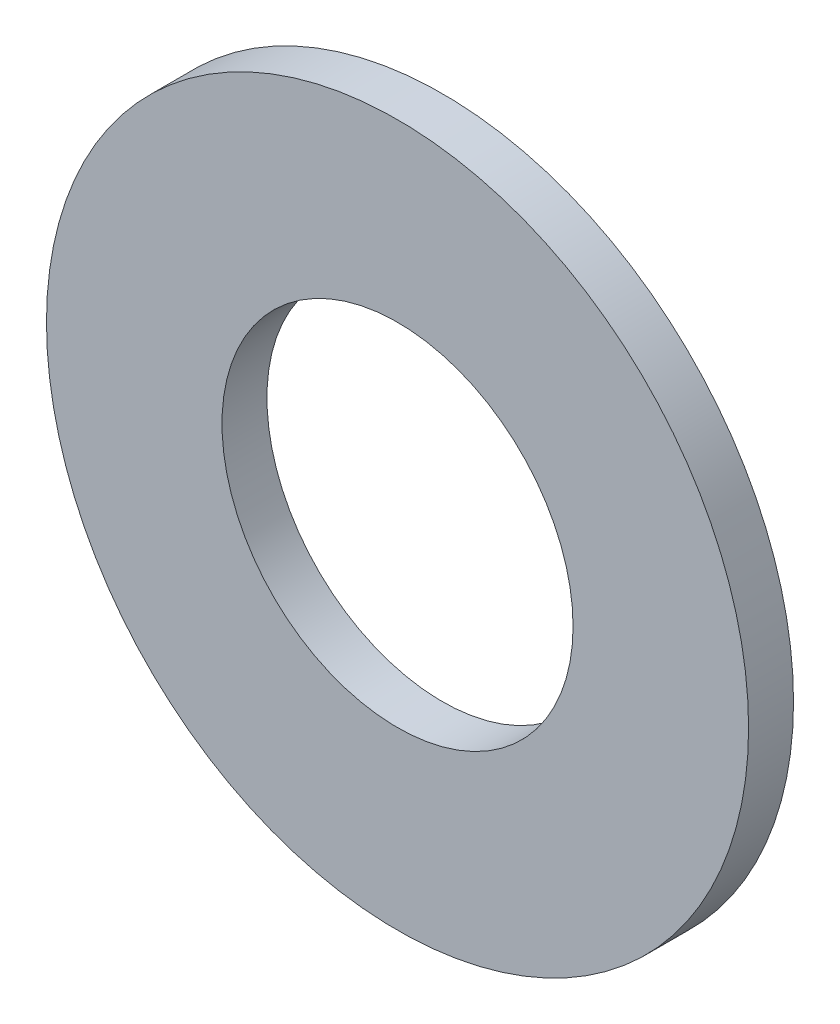
ISO-10303-21;
HEADER;
FILE_DESCRIPTION(('STEP AP214'),'2;1');
FILE_NAME('part.step','',(''),(''),'','','');
FILE_SCHEMA(('AUTOMOTIVE_DESIGN { 1 0 10303 214 1 1 1 1 }'));
ENDSEC;
DATA;
#1=APPLICATION_CONTEXT('core data for automotive mechanical design processes');
#2=APPLICATION_PROTOCOL_DEFINITION('international standard','automotive_design',2000,#1);
#3=PRODUCT_CONTEXT('',#1,'mechanical');
#4=PRODUCT('Part','Part','',(#3));
#5=PRODUCT_RELATED_PRODUCT_CATEGORY('part','',(#4));
#6=PRODUCT_DEFINITION_FORMATION('','',#4);
#7=PRODUCT_DEFINITION_CONTEXT('part definition',#1,'design');
#8=PRODUCT_DEFINITION('design','',#6,#7);
#9=PRODUCT_DEFINITION_SHAPE('','',#8);
#10=(LENGTH_UNIT() NAMED_UNIT(*) SI_UNIT(.MILLI.,.METRE.));
#11=(NAMED_UNIT(*) PLANE_ANGLE_UNIT() SI_UNIT($,.RADIAN.));
#12=(NAMED_UNIT(*) SI_UNIT($,.STERADIAN.) SOLID_ANGLE_UNIT());
#13=UNCERTAINTY_MEASURE_WITH_UNIT(LENGTH_MEASURE(1.E-05),#10,'distance_accuracy_value','');
#14=(GEOMETRIC_REPRESENTATION_CONTEXT(3) GLOBAL_UNCERTAINTY_ASSIGNED_CONTEXT((#13)) GLOBAL_UNIT_ASSIGNED_CONTEXT((#10,
#11,#12)) REPRESENTATION_CONTEXT('',''));
#15=CARTESIAN_POINT('',(0.,0.,0.));
#16=DIRECTION('',(0.,0.,1.));
#17=DIRECTION('',(1.,0.,0.));
#18=AXIS2_PLACEMENT_3D('',#15,#16,#17);
#19=CARTESIAN_POINT('',(0.,0.,-0.508));
#20=DIRECTION('',(0.,0.,1.));
#21=DIRECTION('',(1.,0.,0.));
#22=AXIS2_PLACEMENT_3D('',#19,#20,#21);
#23=CYLINDRICAL_SURFACE('',#22,3.96875);
#24=CARTESIAN_POINT('',(0.,0.,-0.508));
#25=DIRECTION('',(0.,0.,1.));
#26=DIRECTION('',(1.,0.,0.));
#27=AXIS2_PLACEMENT_3D('',#24,#25,#26);
#28=CIRCLE('',#27,3.96875);
#29=CARTESIAN_POINT('',(3.96875,0.,-0.508));
#30=VERTEX_POINT('',#29);
#31=EDGE_CURVE('E10',#30,#30,#28,.T.);
#32=ORIENTED_EDGE('',*,*,#31,.T.);
#33=EDGE_LOOP('',(#32));
#34=FACE_BOUND('',#33,.T.);
#35=CARTESIAN_POINT('',(0.,0.,0.));
#36=DIRECTION('',(0.,0.,1.));
#37=DIRECTION('',(1.,0.,0.));
#38=AXIS2_PLACEMENT_3D('',#35,#36,#37);
#39=CIRCLE('',#38,3.96875);
#40=CARTESIAN_POINT('',(3.96875,0.,0.));
#41=VERTEX_POINT('',#40);
#42=EDGE_CURVE('E40',#41,#41,#39,.T.);
#43=ORIENTED_EDGE('',*,*,#42,.F.);
#44=EDGE_LOOP('',(#43));
#45=FACE_BOUND('',#44,.T.);
#46=ADVANCED_FACE('F37',(#34,#45),#23,.T.);
#47=CARTESIAN_POINT('',(0.,0.,-0.508));
#48=DIRECTION('',(0.,0.,1.));
#49=DIRECTION('',(1.,0.,0.));
#50=AXIS2_PLACEMENT_3D('',#47,#48,#49);
#51=PLANE('',#50);
#52=CARTESIAN_POINT('',(0.,0.,-0.508));
#53=DIRECTION('',(0.,0.,1.));
#54=DIRECTION('',(1.,0.,0.));
#55=AXIS2_PLACEMENT_3D('',#52,#53,#54);
#56=CIRCLE('',#55,1.984375);
#57=CARTESIAN_POINT('',(1.984375,0.,-0.508));
#58=VERTEX_POINT('',#57);
#59=EDGE_CURVE('E47',#58,#58,#56,.T.);
#60=ORIENTED_EDGE('',*,*,#59,.T.);
#61=EDGE_LOOP('',(#60));
#62=FACE_BOUND('',#61,.T.);
#63=ORIENTED_EDGE('',*,*,#31,.F.);
#64=EDGE_LOOP('',(#63));
#65=FACE_BOUND('',#64,.T.);
#66=ADVANCED_FACE('F55',(#62,#65),#51,.F.);
#67=CARTESIAN_POINT('',(0.,0.,0.));
#68=DIRECTION('',(0.,0.,1.));
#69=DIRECTION('',(1.,0.,0.));
#70=AXIS2_PLACEMENT_3D('',#67,#68,#69);
#71=PLANE('',#70);
#72=CARTESIAN_POINT('',(0.,0.,0.));
#73=DIRECTION('',(0.,0.,1.));
#74=DIRECTION('',(1.,0.,0.));
#75=AXIS2_PLACEMENT_3D('',#72,#73,#74);
#76=CIRCLE('',#75,1.984375);
#77=CARTESIAN_POINT('',(1.984375,0.,0.));
#78=VERTEX_POINT('',#77);
#79=EDGE_CURVE('E49',#78,#78,#76,.T.);
#80=ORIENTED_EDGE('',*,*,#79,.F.);
#81=EDGE_LOOP('',(#80));
#82=FACE_BOUND('',#81,.T.);
#83=ORIENTED_EDGE('',*,*,#42,.T.);
#84=EDGE_LOOP('',(#83));
#85=FACE_BOUND('',#84,.T.);
#86=ADVANCED_FACE('F61',(#82,#85),#71,.T.);
#87=CARTESIAN_POINT('',(0.,0.,-0.508));
#88=DIRECTION('',(0.,0.,1.));
#89=DIRECTION('',(1.,0.,0.));
#90=AXIS2_PLACEMENT_3D('',#87,#88,#89);
#91=CYLINDRICAL_SURFACE('',#90,1.984375);
#92=ORIENTED_EDGE('',*,*,#59,.F.);
#93=EDGE_LOOP('',(#92));
#94=FACE_BOUND('',#93,.T.);
#95=ORIENTED_EDGE('',*,*,#79,.T.);
#96=EDGE_LOOP('',(#95));
#97=FACE_BOUND('',#96,.T.);
#98=ADVANCED_FACE('F58',(#94,#97),#91,.F.);
#99=CLOSED_SHELL('',(#46,#66,#86,#98));
#100=MANIFOLD_SOLID_BREP('B2',#99);
#101=ADVANCED_BREP_SHAPE_REPRESENTATION('',(#18,#100),#14);
#102=SHAPE_DEFINITION_REPRESENTATION(#9,#101);
ENDSEC;
END-ISO-10303-21;
